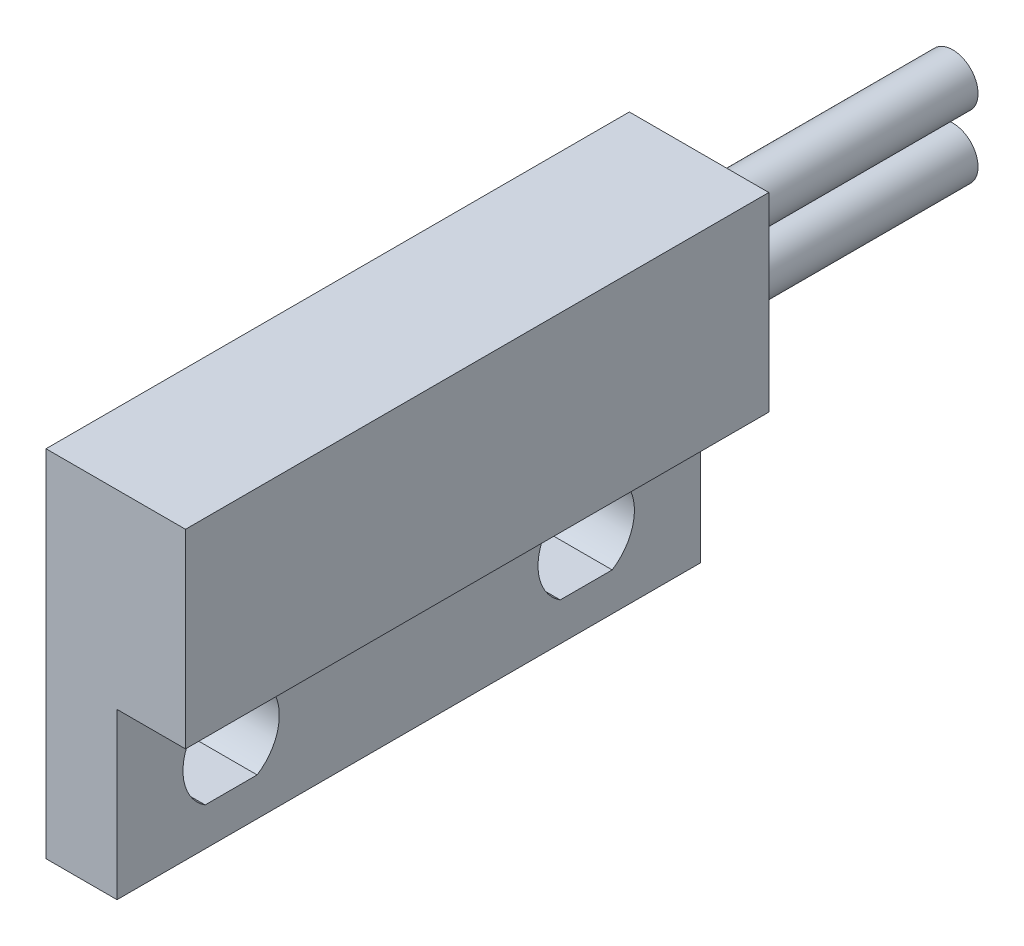
ISO-10303-21;
HEADER;
FILE_DESCRIPTION(('STEP AP214'),'2;1');
FILE_NAME('part.step','',(''),(''),'','','');
FILE_SCHEMA(('AUTOMOTIVE_DESIGN { 1 0 10303 214 1 1 1 1 }'));
ENDSEC;
DATA;
#1=APPLICATION_CONTEXT('core data for automotive mechanical design processes');
#2=APPLICATION_PROTOCOL_DEFINITION('international standard','automotive_design',2000,#1);
#3=PRODUCT_CONTEXT('',#1,'mechanical');
#4=PRODUCT('Part','Part','',(#3));
#5=PRODUCT_RELATED_PRODUCT_CATEGORY('part','',(#4));
#6=PRODUCT_DEFINITION_FORMATION('','',#4);
#7=PRODUCT_DEFINITION_CONTEXT('part definition',#1,'design');
#8=PRODUCT_DEFINITION('design','',#6,#7);
#9=PRODUCT_DEFINITION_SHAPE('','',#8);
#10=(LENGTH_UNIT() NAMED_UNIT(*) SI_UNIT(.MILLI.,.METRE.));
#11=(NAMED_UNIT(*) PLANE_ANGLE_UNIT() SI_UNIT($,.RADIAN.));
#12=(NAMED_UNIT(*) SI_UNIT($,.STERADIAN.) SOLID_ANGLE_UNIT());
#13=UNCERTAINTY_MEASURE_WITH_UNIT(LENGTH_MEASURE(1.E-05),#10,'distance_accuracy_value','');
#14=(GEOMETRIC_REPRESENTATION_CONTEXT(3) GLOBAL_UNCERTAINTY_ASSIGNED_CONTEXT((#13)) GLOBAL_UNIT_ASSIGNED_CONTEXT((#10,
#11,#12)) REPRESENTATION_CONTEXT('',''));
#15=CARTESIAN_POINT('',(0.,0.,0.));
#16=DIRECTION('',(0.,0.,1.));
#17=DIRECTION('',(1.,0.,0.));
#18=AXIS2_PLACEMENT_3D('',#15,#16,#17);
#19=CARTESIAN_POINT('',(2.8,0.,-11.5));
#20=DIRECTION('',(0.,-1.,0.));
#21=DIRECTION('',(1.,0.,0.));
#22=AXIS2_PLACEMENT_3D('',#19,#20,#21);
#23=PLANE('',#22);
#24=DIRECTION('',(1.,0.,0.));
#25=VECTOR('',#24,1.);
#26=CARTESIAN_POINT('',(2.8,0.,11.5));
#27=LINE('',#26,#25);
#28=CARTESIAN_POINT('',(0.,0.,11.5));
#29=VERTEX_POINT('',#28);
#30=CARTESIAN_POINT('',(2.8,0.,11.5));
#31=VERTEX_POINT('',#30);
#32=EDGE_CURVE('E244',#29,#31,#27,.T.);
#33=ORIENTED_EDGE('',*,*,#32,.F.);
#34=DIRECTION('',(0.,0.,1.));
#35=VECTOR('',#34,1.);
#36=CARTESIAN_POINT('',(0.,0.,-11.5));
#37=LINE('',#36,#35);
#38=CARTESIAN_POINT('',(0.,0.,-11.5));
#39=VERTEX_POINT('',#38);
#40=EDGE_CURVE('E11',#39,#29,#37,.T.);
#41=ORIENTED_EDGE('',*,*,#40,.F.);
#42=DIRECTION('',(1.,0.,0.));
#43=VECTOR('',#42,1.);
#44=CARTESIAN_POINT('',(2.8,0.,-11.5));
#45=LINE('',#44,#43);
#46=CARTESIAN_POINT('',(2.8,0.,-11.5));
#47=VERTEX_POINT('',#46);
#48=EDGE_CURVE('E248',#39,#47,#45,.T.);
#49=ORIENTED_EDGE('',*,*,#48,.T.);
#50=DIRECTION('',(0.,0.,1.));
#51=VECTOR('',#50,1.);
#52=CARTESIAN_POINT('',(2.8,0.,-11.5));
#53=LINE('',#52,#51);
#54=EDGE_CURVE('E45',#47,#31,#53,.T.);
#55=ORIENTED_EDGE('',*,*,#54,.T.);
#56=EDGE_LOOP('',(#33,#41,#49,#55));
#57=FACE_BOUND('',#56,.T.);
#58=ADVANCED_FACE('F42',(#57),#23,.T.);
#59=CARTESIAN_POINT('',(0.,0.,-11.5));
#60=DIRECTION('',(-1.,0.,0.));
#61=DIRECTION('',(0.,0.,1.));
#62=AXIS2_PLACEMENT_3D('',#59,#60,#61);
#63=PLANE('',#62);
#64=CARTESIAN_POINT('',(0.,3.1,7.));
#65=DIRECTION('',(-1.,0.,0.));
#66=DIRECTION('',(0.,0.,1.));
#67=AXIS2_PLACEMENT_3D('',#64,#65,#66);
#68=CIRCLE('',#67,1.9);
#69=CARTESIAN_POINT('',(0.,4.7,5.97530492340404));
#70=VERTEX_POINT('',#69);
#71=CARTESIAN_POINT('',(0.,1.5,5.97530492340404));
#72=VERTEX_POINT('',#71);
#73=EDGE_CURVE('E228',#70,#72,#68,.T.);
#74=ORIENTED_EDGE('',*,*,#73,.F.);
#75=DIRECTION('',(0.,0.,-1.));
#76=VECTOR('',#75,1.);
#77=CARTESIAN_POINT('',(0.,4.69999999999999,-11.5));
#78=LINE('',#77,#76);
#79=CARTESIAN_POINT('',(0.,4.7,8.02469507659596));
#80=VERTEX_POINT('',#79);
#81=EDGE_CURVE('E220',#80,#70,#78,.T.);
#82=ORIENTED_EDGE('',*,*,#81,.F.);
#83=CARTESIAN_POINT('',(0.,3.1,7.));
#84=DIRECTION('',(-1.,0.,0.));
#85=DIRECTION('',(0.,0.,1.));
#86=AXIS2_PLACEMENT_3D('',#83,#84,#85);
#87=CIRCLE('',#86,1.9);
#88=CARTESIAN_POINT('',(0.,1.5,8.02469507659596));
#89=VERTEX_POINT('',#88);
#90=EDGE_CURVE('E149',#89,#80,#87,.T.);
#91=ORIENTED_EDGE('',*,*,#90,.F.);
#92=DIRECTION('',(0.,0.,1.));
#93=VECTOR('',#92,1.);
#94=CARTESIAN_POINT('',(0.,1.50000000000001,-11.5));
#95=LINE('',#94,#93);
#96=EDGE_CURVE('E225',#72,#89,#95,.T.);
#97=ORIENTED_EDGE('',*,*,#96,.F.);
#98=EDGE_LOOP('',(#74,#82,#91,#97));
#99=FACE_BOUND('',#98,.T.);
#100=CARTESIAN_POINT('',(0.,3.1,-7.));
#101=DIRECTION('',(-1.,0.,0.));
#102=DIRECTION('',(0.,0.,1.));
#103=AXIS2_PLACEMENT_3D('',#100,#101,#102);
#104=CIRCLE('',#103,1.9);
#105=CARTESIAN_POINT('',(0.,1.5,-5.97530492340404));
#106=VERTEX_POINT('',#105);
#107=CARTESIAN_POINT('',(0.,4.7,-5.97530492340404));
#108=VERTEX_POINT('',#107);
#109=EDGE_CURVE('E217',#106,#108,#104,.T.);
#110=ORIENTED_EDGE('',*,*,#109,.F.);
#111=DIRECTION('',(0.,0.,1.));
#112=VECTOR('',#111,1.);
#113=CARTESIAN_POINT('',(0.,1.5,-11.5));
#114=LINE('',#113,#112);
#115=CARTESIAN_POINT('',(0.,1.5,-8.02469507659596));
#116=VERTEX_POINT('',#115);
#117=EDGE_CURVE('E178',#116,#106,#114,.T.);
#118=ORIENTED_EDGE('',*,*,#117,.F.);
#119=CARTESIAN_POINT('',(0.,3.1,-7.));
#120=DIRECTION('',(-1.,0.,0.));
#121=DIRECTION('',(0.,0.,1.));
#122=AXIS2_PLACEMENT_3D('',#119,#120,#121);
#123=CIRCLE('',#122,1.9);
#124=CARTESIAN_POINT('',(0.,4.7,-8.02469507659596));
#125=VERTEX_POINT('',#124);
#126=EDGE_CURVE('E211',#125,#116,#123,.T.);
#127=ORIENTED_EDGE('',*,*,#126,.F.);
#128=DIRECTION('',(0.,0.,-1.));
#129=VECTOR('',#128,1.);
#130=CARTESIAN_POINT('',(0.,4.7,-11.5));
#131=LINE('',#130,#129);
#132=EDGE_CURVE('E214',#108,#125,#131,.T.);
#133=ORIENTED_EDGE('',*,*,#132,.F.);
#134=EDGE_LOOP('',(#110,#118,#127,#133));
#135=FACE_BOUND('',#134,.T.);
#136=DIRECTION('',(0.,-1.,0.));
#137=VECTOR('',#136,1.);
#138=CARTESIAN_POINT('',(0.,0.,11.5));
#139=LINE('',#138,#137);
#140=CARTESIAN_POINT('',(0.,14.,11.5));
#141=VERTEX_POINT('',#140);
#142=EDGE_CURVE('E253',#141,#29,#139,.T.);
#143=ORIENTED_EDGE('',*,*,#142,.F.);
#144=DIRECTION('',(0.,0.,1.));
#145=VECTOR('',#144,1.);
#146=CARTESIAN_POINT('',(0.,14.,-11.5));
#147=LINE('',#146,#145);
#148=CARTESIAN_POINT('',(0.,14.,-11.5));
#149=VERTEX_POINT('',#148);
#150=EDGE_CURVE('E51',#149,#141,#147,.T.);
#151=ORIENTED_EDGE('',*,*,#150,.F.);
#152=DIRECTION('',(0.,-1.,0.));
#153=VECTOR('',#152,1.);
#154=CARTESIAN_POINT('',(0.,0.,-11.5));
#155=LINE('',#154,#153);
#156=EDGE_CURVE('E269',#149,#39,#155,.T.);
#157=ORIENTED_EDGE('',*,*,#156,.T.);
#158=ORIENTED_EDGE('',*,*,#40,.T.);
#159=EDGE_LOOP('',(#143,#151,#157,#158));
#160=FACE_BOUND('',#159,.T.);
#161=ADVANCED_FACE('F317',(#99,#135,#160),#63,.T.);
#162=CARTESIAN_POINT('',(0.,14.,-11.5));
#163=DIRECTION('',(0.,1.,0.));
#164=DIRECTION('',(0.,0.,1.));
#165=AXIS2_PLACEMENT_3D('',#162,#163,#164);
#166=PLANE('',#165);
#167=DIRECTION('',(-1.,0.,0.));
#168=VECTOR('',#167,1.);
#169=CARTESIAN_POINT('',(0.,14.,11.5));
#170=LINE('',#169,#168);
#171=CARTESIAN_POINT('',(5.5,14.,11.5));
#172=VERTEX_POINT('',#171);
#173=EDGE_CURVE('E288',#172,#141,#170,.T.);
#174=ORIENTED_EDGE('',*,*,#173,.F.);
#175=DIRECTION('',(0.,0.,1.));
#176=VECTOR('',#175,1.);
#177=CARTESIAN_POINT('',(5.5,14.,-11.5));
#178=LINE('',#177,#176);
#179=CARTESIAN_POINT('',(5.5,14.,-11.5));
#180=VERTEX_POINT('',#179);
#181=EDGE_CURVE('E297',#180,#172,#178,.T.);
#182=ORIENTED_EDGE('',*,*,#181,.F.);
#183=DIRECTION('',(-1.,0.,0.));
#184=VECTOR('',#183,1.);
#185=CARTESIAN_POINT('',(0.,14.,-11.5));
#186=LINE('',#185,#184);
#187=EDGE_CURVE('E265',#180,#149,#186,.T.);
#188=ORIENTED_EDGE('',*,*,#187,.T.);
#189=ORIENTED_EDGE('',*,*,#150,.T.);
#190=EDGE_LOOP('',(#174,#182,#188,#189));
#191=FACE_BOUND('',#190,.T.);
#192=ADVANCED_FACE('F330',(#191),#166,.T.);
#193=CARTESIAN_POINT('',(5.5,14.,-11.5));
#194=DIRECTION('',(1.,0.,0.));
#195=DIRECTION('',(0.,1.,0.));
#196=AXIS2_PLACEMENT_3D('',#193,#194,#195);
#197=PLANE('',#196);
#198=DIRECTION('',(0.,1.,0.));
#199=VECTOR('',#198,1.);
#200=CARTESIAN_POINT('',(5.5,14.,11.5));
#201=LINE('',#200,#199);
#202=CARTESIAN_POINT('',(5.5,6.5,11.5));
#203=VERTEX_POINT('',#202);
#204=EDGE_CURVE('E284',#203,#172,#201,.T.);
#205=ORIENTED_EDGE('',*,*,#204,.F.);
#206=DIRECTION('',(0.,0.,1.));
#207=VECTOR('',#206,1.);
#208=CARTESIAN_POINT('',(5.5,6.5,-11.5));
#209=LINE('',#208,#207);
#210=CARTESIAN_POINT('',(5.5,6.5,-11.5));
#211=VERTEX_POINT('',#210);
#212=EDGE_CURVE('E300',#211,#203,#209,.T.);
#213=ORIENTED_EDGE('',*,*,#212,.F.);
#214=DIRECTION('',(0.,1.,0.));
#215=VECTOR('',#214,1.);
#216=CARTESIAN_POINT('',(5.5,14.,-11.5));
#217=LINE('',#216,#215);
#218=EDGE_CURVE('E261',#211,#180,#217,.T.);
#219=ORIENTED_EDGE('',*,*,#218,.T.);
#220=ORIENTED_EDGE('',*,*,#181,.T.);
#221=EDGE_LOOP('',(#205,#213,#219,#220));
#222=FACE_BOUND('',#221,.T.);
#223=ADVANCED_FACE('F328',(#222),#197,.T.);
#224=CARTESIAN_POINT('',(5.5,6.5,-11.5));
#225=DIRECTION('',(0.,-1.,0.));
#226=DIRECTION('',(0.,0.,-1.));
#227=AXIS2_PLACEMENT_3D('',#224,#225,#226);
#228=PLANE('',#227);
#229=DIRECTION('',(1.,0.,0.));
#230=VECTOR('',#229,1.);
#231=CARTESIAN_POINT('',(5.5,6.5,11.5));
#232=LINE('',#231,#230);
#233=CARTESIAN_POINT('',(2.8,6.5,11.5));
#234=VERTEX_POINT('',#233);
#235=EDGE_CURVE('E280',#234,#203,#232,.T.);
#236=ORIENTED_EDGE('',*,*,#235,.F.);
#237=DIRECTION('',(0.,0.,1.));
#238=VECTOR('',#237,1.);
#239=CARTESIAN_POINT('',(2.8,6.5,-11.5));
#240=LINE('',#239,#238);
#241=CARTESIAN_POINT('',(2.8,6.5,-11.5));
#242=VERTEX_POINT('',#241);
#243=EDGE_CURVE('E302',#242,#234,#240,.T.);
#244=ORIENTED_EDGE('',*,*,#243,.F.);
#245=DIRECTION('',(1.,0.,0.));
#246=VECTOR('',#245,1.);
#247=CARTESIAN_POINT('',(5.5,6.5,-11.5));
#248=LINE('',#247,#246);
#249=EDGE_CURVE('E257',#242,#211,#248,.T.);
#250=ORIENTED_EDGE('',*,*,#249,.T.);
#251=ORIENTED_EDGE('',*,*,#212,.T.);
#252=EDGE_LOOP('',(#236,#244,#250,#251));
#253=FACE_BOUND('',#252,.T.);
#254=ADVANCED_FACE('F325',(#253),#228,.T.);
#255=CARTESIAN_POINT('',(2.8,6.5,-11.5));
#256=DIRECTION('',(1.,0.,0.));
#257=DIRECTION('',(0.,1.,0.));
#258=AXIS2_PLACEMENT_3D('',#255,#256,#257);
#259=PLANE('',#258);
#260=CARTESIAN_POINT('',(2.8,3.1,7.));
#261=DIRECTION('',(1.,0.,0.));
#262=DIRECTION('',(0.,1.,0.));
#263=AXIS2_PLACEMENT_3D('',#260,#261,#262);
#264=CIRCLE('',#263,1.9);
#265=CARTESIAN_POINT('',(2.8,1.5,5.97530492340404));
#266=VERTEX_POINT('',#265);
#267=CARTESIAN_POINT('',(2.8,4.7,5.97530492340405));
#268=VERTEX_POINT('',#267);
#269=EDGE_CURVE('E163',#266,#268,#264,.T.);
#270=ORIENTED_EDGE('',*,*,#269,.F.);
#271=DIRECTION('',(0.,0.,-1.));
#272=VECTOR('',#271,1.);
#273=CARTESIAN_POINT('',(2.8,1.5,8.02469507659596));
#274=LINE('',#273,#272);
#275=CARTESIAN_POINT('',(2.8,1.5,8.02469507659596));
#276=VERTEX_POINT('',#275);
#277=EDGE_CURVE('E168',#276,#266,#274,.T.);
#278=ORIENTED_EDGE('',*,*,#277,.F.);
#279=CARTESIAN_POINT('',(2.8,3.1,7.));
#280=DIRECTION('',(1.,0.,0.));
#281=DIRECTION('',(0.,1.,0.));
#282=AXIS2_PLACEMENT_3D('',#279,#280,#281);
#283=CIRCLE('',#282,1.9);
#284=CARTESIAN_POINT('',(2.8,4.7,8.02469507659596));
#285=VERTEX_POINT('',#284);
#286=EDGE_CURVE('E146',#285,#276,#283,.T.);
#287=ORIENTED_EDGE('',*,*,#286,.F.);
#288=DIRECTION('',(0.,0.,1.));
#289=VECTOR('',#288,1.);
#290=CARTESIAN_POINT('',(2.8,4.7,8.02469507659596));
#291=LINE('',#290,#289);
#292=EDGE_CURVE('E157',#268,#285,#291,.T.);
#293=ORIENTED_EDGE('',*,*,#292,.F.);
#294=EDGE_LOOP('',(#270,#278,#287,#293));
#295=FACE_BOUND('',#294,.T.);
#296=CARTESIAN_POINT('',(2.8,3.1,-7.));
#297=DIRECTION('',(1.,0.,0.));
#298=DIRECTION('',(0.,1.,0.));
#299=AXIS2_PLACEMENT_3D('',#296,#297,#298);
#300=CIRCLE('',#299,1.9);
#301=CARTESIAN_POINT('',(2.8,4.7,-5.97530492340404));
#302=VERTEX_POINT('',#301);
#303=CARTESIAN_POINT('',(2.8,1.5,-5.97530492340404));
#304=VERTEX_POINT('',#303);
#305=EDGE_CURVE('E183',#302,#304,#300,.T.);
#306=ORIENTED_EDGE('',*,*,#305,.F.);
#307=DIRECTION('',(0.,0.,1.));
#308=VECTOR('',#307,1.);
#309=CARTESIAN_POINT('',(2.8,4.7,-8.02469507659596));
#310=LINE('',#309,#308);
#311=CARTESIAN_POINT('',(2.8,4.7,-8.02469507659596));
#312=VERTEX_POINT('',#311);
#313=EDGE_CURVE('E193',#312,#302,#310,.T.);
#314=ORIENTED_EDGE('',*,*,#313,.F.);
#315=CARTESIAN_POINT('',(2.8,3.1,-7.));
#316=DIRECTION('',(1.,0.,0.));
#317=DIRECTION('',(0.,1.,0.));
#318=AXIS2_PLACEMENT_3D('',#315,#316,#317);
#319=CIRCLE('',#318,1.9);
#320=CARTESIAN_POINT('',(2.8,1.5,-8.02469507659596));
#321=VERTEX_POINT('',#320);
#322=EDGE_CURVE('E189',#321,#312,#319,.T.);
#323=ORIENTED_EDGE('',*,*,#322,.F.);
#324=DIRECTION('',(0.,0.,-1.));
#325=VECTOR('',#324,1.);
#326=CARTESIAN_POINT('',(2.8,1.5,-8.02469507659596));
#327=LINE('',#326,#325);
#328=EDGE_CURVE('E186',#304,#321,#327,.T.);
#329=ORIENTED_EDGE('',*,*,#328,.F.);
#330=EDGE_LOOP('',(#306,#314,#323,#329));
#331=FACE_BOUND('',#330,.T.);
#332=DIRECTION('',(0.,1.,0.));
#333=VECTOR('',#332,1.);
#334=CARTESIAN_POINT('',(2.8,6.5,11.5));
#335=LINE('',#334,#333);
#336=EDGE_CURVE('E276',#31,#234,#335,.T.);
#337=ORIENTED_EDGE('',*,*,#336,.F.);
#338=ORIENTED_EDGE('',*,*,#54,.F.);
#339=DIRECTION('',(0.,1.,0.));
#340=VECTOR('',#339,1.);
#341=CARTESIAN_POINT('',(2.8,6.5,-11.5));
#342=LINE('',#341,#340);
#343=EDGE_CURVE('E252',#47,#242,#342,.T.);
#344=ORIENTED_EDGE('',*,*,#343,.T.);
#345=ORIENTED_EDGE('',*,*,#243,.T.);
#346=EDGE_LOOP('',(#337,#338,#344,#345));
#347=FACE_BOUND('',#346,.T.);
#348=ADVANCED_FACE('F165',(#295,#331,#347),#259,.T.);
#349=CARTESIAN_POINT('',(0.,0.,-11.5));
#350=DIRECTION('',(0.,0.,-1.));
#351=DIRECTION('',(-1.,0.,0.));
#352=AXIS2_PLACEMENT_3D('',#349,#350,#351);
#353=PLANE('',#352);
#354=CARTESIAN_POINT('',(2.75,11.5,-11.5));
#355=DIRECTION('',(0.,0.,-1.));
#356=DIRECTION('',(-1.,0.,0.));
#357=AXIS2_PLACEMENT_3D('',#354,#355,#356);
#358=CIRCLE('',#357,1.);
#359=CARTESIAN_POINT('',(1.75,11.5,-11.5));
#360=VERTEX_POINT('',#359);
#361=EDGE_CURVE('E231',#360,#360,#358,.T.);
#362=ORIENTED_EDGE('',*,*,#361,.F.);
#363=EDGE_LOOP('',(#362));
#364=FACE_BOUND('',#363,.T.);
#365=CARTESIAN_POINT('',(2.75,9.,-11.5));
#366=DIRECTION('',(0.,0.,-1.));
#367=DIRECTION('',(-1.,0.,0.));
#368=AXIS2_PLACEMENT_3D('',#365,#366,#367);
#369=CIRCLE('',#368,1.);
#370=CARTESIAN_POINT('',(1.75,9.,-11.5));
#371=VERTEX_POINT('',#370);
#372=EDGE_CURVE('E236',#371,#371,#369,.T.);
#373=ORIENTED_EDGE('',*,*,#372,.F.);
#374=EDGE_LOOP('',(#373));
#375=FACE_BOUND('',#374,.T.);
#376=ORIENTED_EDGE('',*,*,#48,.F.);
#377=ORIENTED_EDGE('',*,*,#156,.F.);
#378=ORIENTED_EDGE('',*,*,#187,.F.);
#379=ORIENTED_EDGE('',*,*,#218,.F.);
#380=ORIENTED_EDGE('',*,*,#249,.F.);
#381=ORIENTED_EDGE('',*,*,#343,.F.);
#382=EDGE_LOOP('',(#376,#377,#378,#379,#380,#381));
#383=FACE_BOUND('',#382,.T.);
#384=ADVANCED_FACE('F320',(#364,#375,#383),#353,.T.);
#385=CARTESIAN_POINT('',(0.,0.,11.5));
#386=DIRECTION('',(0.,0.,-1.));
#387=DIRECTION('',(-1.,0.,0.));
#388=AXIS2_PLACEMENT_3D('',#385,#386,#387);
#389=PLANE('',#388);
#390=ORIENTED_EDGE('',*,*,#32,.T.);
#391=ORIENTED_EDGE('',*,*,#336,.T.);
#392=ORIENTED_EDGE('',*,*,#235,.T.);
#393=ORIENTED_EDGE('',*,*,#204,.T.);
#394=ORIENTED_EDGE('',*,*,#173,.T.);
#395=ORIENTED_EDGE('',*,*,#142,.T.);
#396=EDGE_LOOP('',(#390,#391,#392,#393,#394,#395));
#397=FACE_BOUND('',#396,.T.);
#398=ADVANCED_FACE('F313',(#397),#389,.F.);
#399=CARTESIAN_POINT('',(2.75,9.,-21.5));
#400=DIRECTION('',(0.,0.,1.));
#401=DIRECTION('',(1.,0.,0.));
#402=AXIS2_PLACEMENT_3D('',#399,#400,#401);
#403=CYLINDRICAL_SURFACE('',#402,1.);
#404=CARTESIAN_POINT('',(2.75,9.,-21.5));
#405=DIRECTION('',(0.,0.,-1.));
#406=DIRECTION('',(-1.,0.,0.));
#407=AXIS2_PLACEMENT_3D('',#404,#405,#406);
#408=CIRCLE('',#407,1.);
#409=CARTESIAN_POINT('',(1.75,9.,-21.5));
#410=VERTEX_POINT('',#409);
#411=EDGE_CURVE('E240',#410,#410,#408,.T.);
#412=ORIENTED_EDGE('',*,*,#411,.F.);
#413=EDGE_LOOP('',(#412));
#414=FACE_BOUND('',#413,.T.);
#415=ORIENTED_EDGE('',*,*,#372,.T.);
#416=EDGE_LOOP('',(#415));
#417=FACE_BOUND('',#416,.T.);
#418=ADVANCED_FACE('F454',(#414,#417),#403,.T.);
#419=CARTESIAN_POINT('',(2.75,9.,-21.5));
#420=DIRECTION('',(0.,0.,-1.));
#421=DIRECTION('',(-1.,0.,0.));
#422=AXIS2_PLACEMENT_3D('',#419,#420,#421);
#423=PLANE('',#422);
#424=ORIENTED_EDGE('',*,*,#411,.T.);
#425=EDGE_LOOP('',(#424));
#426=FACE_BOUND('',#425,.T.);
#427=ADVANCED_FACE('F460',(#426),#423,.T.);
#428=CARTESIAN_POINT('',(2.75,11.5,-21.5));
#429=DIRECTION('',(0.,0.,1.));
#430=DIRECTION('',(1.,0.,0.));
#431=AXIS2_PLACEMENT_3D('',#428,#429,#430);
#432=CYLINDRICAL_SURFACE('',#431,1.);
#433=CARTESIAN_POINT('',(2.75,11.5,-21.5));
#434=DIRECTION('',(0.,0.,-1.));
#435=DIRECTION('',(-1.,0.,0.));
#436=AXIS2_PLACEMENT_3D('',#433,#434,#435);
#437=CIRCLE('',#436,1.);
#438=CARTESIAN_POINT('',(1.75,11.5,-21.5));
#439=VERTEX_POINT('',#438);
#440=EDGE_CURVE('E232',#439,#439,#437,.T.);
#441=ORIENTED_EDGE('',*,*,#440,.F.);
#442=EDGE_LOOP('',(#441));
#443=FACE_BOUND('',#442,.T.);
#444=ORIENTED_EDGE('',*,*,#361,.T.);
#445=EDGE_LOOP('',(#444));
#446=FACE_BOUND('',#445,.T.);
#447=ADVANCED_FACE('F469',(#443,#446),#432,.T.);
#448=CARTESIAN_POINT('',(2.75,11.5,-21.5));
#449=DIRECTION('',(0.,0.,-1.));
#450=DIRECTION('',(-1.,0.,0.));
#451=AXIS2_PLACEMENT_3D('',#448,#449,#450);
#452=PLANE('',#451);
#453=ORIENTED_EDGE('',*,*,#440,.T.);
#454=EDGE_LOOP('',(#453));
#455=FACE_BOUND('',#454,.T.);
#456=ADVANCED_FACE('F422',(#455),#452,.T.);
#457=CARTESIAN_POINT('',(-7.2,3.1,-7.));
#458=DIRECTION('',(1.,0.,0.));
#459=DIRECTION('',(0.,1.,0.));
#460=AXIS2_PLACEMENT_3D('',#457,#458,#459);
#461=CYLINDRICAL_SURFACE('',#460,1.9);
#462=ORIENTED_EDGE('',*,*,#109,.T.);
#463=DIRECTION('',(1.,0.,0.));
#464=VECTOR('',#463,1.);
#465=CARTESIAN_POINT('',(-7.2,4.7,-5.97530492340404));
#466=LINE('',#465,#464);
#467=EDGE_CURVE('E198',#108,#302,#466,.T.);
#468=ORIENTED_EDGE('',*,*,#467,.T.);
#469=ORIENTED_EDGE('',*,*,#305,.T.);
#470=DIRECTION('',(1.,0.,0.));
#471=VECTOR('',#470,1.);
#472=CARTESIAN_POINT('',(-7.2,1.5,-5.97530492340404));
#473=LINE('',#472,#471);
#474=EDGE_CURVE('E197',#106,#304,#473,.T.);
#475=ORIENTED_EDGE('',*,*,#474,.F.);
#476=EDGE_LOOP('',(#462,#468,#469,#475));
#477=FACE_BOUND('',#476,.T.);
#478=ADVANCED_FACE('F365',(#477),#461,.F.);
#479=CARTESIAN_POINT('',(-7.2,4.7,-8.02469507659596));
#480=DIRECTION('',(0.,1.,0.));
#481=DIRECTION('',(-1.,0.,0.));
#482=AXIS2_PLACEMENT_3D('',#479,#480,#481);
#483=PLANE('',#482);
#484=ORIENTED_EDGE('',*,*,#132,.T.);
#485=DIRECTION('',(1.,0.,0.));
#486=VECTOR('',#485,1.);
#487=CARTESIAN_POINT('',(-7.2,4.7,-8.02469507659596));
#488=LINE('',#487,#486);
#489=EDGE_CURVE('E201',#125,#312,#488,.T.);
#490=ORIENTED_EDGE('',*,*,#489,.T.);
#491=ORIENTED_EDGE('',*,*,#313,.T.);
#492=ORIENTED_EDGE('',*,*,#467,.F.);
#493=EDGE_LOOP('',(#484,#490,#491,#492));
#494=FACE_BOUND('',#493,.T.);
#495=ADVANCED_FACE('F359',(#494),#483,.F.);
#496=CARTESIAN_POINT('',(-7.2,3.1,-7.));
#497=DIRECTION('',(1.,0.,0.));
#498=DIRECTION('',(0.,1.,0.));
#499=AXIS2_PLACEMENT_3D('',#496,#497,#498);
#500=CYLINDRICAL_SURFACE('',#499,1.9);
#501=ORIENTED_EDGE('',*,*,#126,.T.);
#502=DIRECTION('',(1.,0.,0.));
#503=VECTOR('',#502,1.);
#504=CARTESIAN_POINT('',(-7.2,1.5,-8.02469507659596));
#505=LINE('',#504,#503);
#506=EDGE_CURVE('E67',#116,#321,#505,.T.);
#507=ORIENTED_EDGE('',*,*,#506,.T.);
#508=ORIENTED_EDGE('',*,*,#322,.T.);
#509=ORIENTED_EDGE('',*,*,#489,.F.);
#510=EDGE_LOOP('',(#501,#507,#508,#509));
#511=FACE_BOUND('',#510,.T.);
#512=ADVANCED_FACE('F364',(#511),#500,.F.);
#513=CARTESIAN_POINT('',(-7.2,1.5,-8.02469507659596));
#514=DIRECTION('',(0.,-1.,0.));
#515=DIRECTION('',(1.,0.,0.));
#516=AXIS2_PLACEMENT_3D('',#513,#514,#515);
#517=PLANE('',#516);
#518=ORIENTED_EDGE('',*,*,#117,.T.);
#519=ORIENTED_EDGE('',*,*,#474,.T.);
#520=ORIENTED_EDGE('',*,*,#328,.T.);
#521=ORIENTED_EDGE('',*,*,#506,.F.);
#522=EDGE_LOOP('',(#518,#519,#520,#521));
#523=FACE_BOUND('',#522,.T.);
#524=ADVANCED_FACE('F397',(#523),#517,.F.);
#525=CARTESIAN_POINT('',(-7.2,3.1,7.));
#526=DIRECTION('',(1.,0.,0.));
#527=DIRECTION('',(0.,1.,0.));
#528=AXIS2_PLACEMENT_3D('',#525,#526,#527);
#529=CYLINDRICAL_SURFACE('',#528,1.9);
#530=ORIENTED_EDGE('',*,*,#73,.T.);
#531=DIRECTION('',(1.,0.,0.));
#532=VECTOR('',#531,1.);
#533=CARTESIAN_POINT('',(-7.2,1.5,5.97530492340404));
#534=LINE('',#533,#532);
#535=EDGE_CURVE('E175',#72,#266,#534,.T.);
#536=ORIENTED_EDGE('',*,*,#535,.T.);
#537=ORIENTED_EDGE('',*,*,#269,.T.);
#538=DIRECTION('',(1.,0.,0.));
#539=VECTOR('',#538,1.);
#540=CARTESIAN_POINT('',(-7.2,4.7,5.97530492340404));
#541=LINE('',#540,#539);
#542=EDGE_CURVE('E153',#70,#268,#541,.T.);
#543=ORIENTED_EDGE('',*,*,#542,.F.);
#544=EDGE_LOOP('',(#530,#536,#537,#543));
#545=FACE_BOUND('',#544,.T.);
#546=ADVANCED_FACE('F393',(#545),#529,.F.);
#547=CARTESIAN_POINT('',(-7.2,1.5,8.02469507659596));
#548=DIRECTION('',(0.,-1.,0.));
#549=DIRECTION('',(0.,0.,-1.));
#550=AXIS2_PLACEMENT_3D('',#547,#548,#549);
#551=PLANE('',#550);
#552=ORIENTED_EDGE('',*,*,#96,.T.);
#553=DIRECTION('',(1.,0.,0.));
#554=VECTOR('',#553,1.);
#555=CARTESIAN_POINT('',(-7.2,1.5,8.02469507659596));
#556=LINE('',#555,#554);
#557=EDGE_CURVE('E152',#89,#276,#556,.T.);
#558=ORIENTED_EDGE('',*,*,#557,.T.);
#559=ORIENTED_EDGE('',*,*,#277,.T.);
#560=ORIENTED_EDGE('',*,*,#535,.F.);
#561=EDGE_LOOP('',(#552,#558,#559,#560));
#562=FACE_BOUND('',#561,.T.);
#563=ADVANCED_FACE('F386',(#562),#551,.F.);
#564=CARTESIAN_POINT('',(-7.2,3.1,7.));
#565=DIRECTION('',(1.,0.,0.));
#566=DIRECTION('',(0.,1.,0.));
#567=AXIS2_PLACEMENT_3D('',#564,#565,#566);
#568=CYLINDRICAL_SURFACE('',#567,1.9);
#569=ORIENTED_EDGE('',*,*,#90,.T.);
#570=DIRECTION('',(1.,0.,0.));
#571=VECTOR('',#570,1.);
#572=CARTESIAN_POINT('',(-7.2,4.7,8.02469507659596));
#573=LINE('',#572,#571);
#574=EDGE_CURVE('E59',#80,#285,#573,.T.);
#575=ORIENTED_EDGE('',*,*,#574,.T.);
#576=ORIENTED_EDGE('',*,*,#286,.T.);
#577=ORIENTED_EDGE('',*,*,#557,.F.);
#578=EDGE_LOOP('',(#569,#575,#576,#577));
#579=FACE_BOUND('',#578,.T.);
#580=ADVANCED_FACE('F143',(#579),#568,.F.);
#581=CARTESIAN_POINT('',(-7.2,4.7,8.02469507659596));
#582=DIRECTION('',(0.,1.,0.));
#583=DIRECTION('',(0.,0.,1.));
#584=AXIS2_PLACEMENT_3D('',#581,#582,#583);
#585=PLANE('',#584);
#586=ORIENTED_EDGE('',*,*,#81,.T.);
#587=ORIENTED_EDGE('',*,*,#542,.T.);
#588=ORIENTED_EDGE('',*,*,#292,.T.);
#589=ORIENTED_EDGE('',*,*,#574,.F.);
#590=EDGE_LOOP('',(#586,#587,#588,#589));
#591=FACE_BOUND('',#590,.T.);
#592=ADVANCED_FACE('F158',(#591),#585,.F.);
#593=CLOSED_SHELL('',(#58,#161,#192,#223,#254,#348,#384,#398,#418,#427,#447,#456,#478,#495,#512,
#524,#546,#563,#580,#592));
#594=MANIFOLD_SOLID_BREP('B2',#593);
#595=ADVANCED_BREP_SHAPE_REPRESENTATION('',(#18,#594),#14);
#596=SHAPE_DEFINITION_REPRESENTATION(#9,#595);
ENDSEC;
END-ISO-10303-21;
